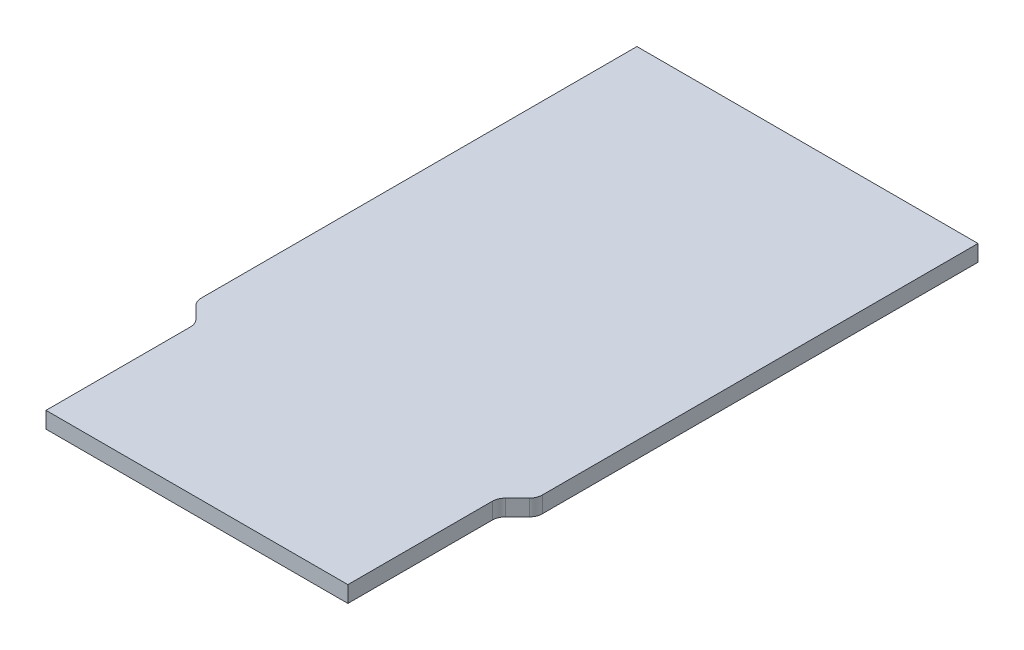
ISO-10303-21;
HEADER;
FILE_DESCRIPTION(('STEP AP214'),'2;1');
FILE_NAME('part.step','',(''),(''),'','','');
FILE_SCHEMA(('AUTOMOTIVE_DESIGN { 1 0 10303 214 1 1 1 1 }'));
ENDSEC;
DATA;
#1=APPLICATION_CONTEXT('core data for automotive mechanical design processes');
#2=APPLICATION_PROTOCOL_DEFINITION('international standard','automotive_design',2000,#1);
#3=PRODUCT_CONTEXT('',#1,'mechanical');
#4=PRODUCT('Part','Part','',(#3));
#5=PRODUCT_RELATED_PRODUCT_CATEGORY('part','',(#4));
#6=PRODUCT_DEFINITION_FORMATION('','',#4);
#7=PRODUCT_DEFINITION_CONTEXT('part definition',#1,'design');
#8=PRODUCT_DEFINITION('design','',#6,#7);
#9=PRODUCT_DEFINITION_SHAPE('','',#8);
#10=(LENGTH_UNIT() NAMED_UNIT(*) SI_UNIT(.MILLI.,.METRE.));
#11=(NAMED_UNIT(*) PLANE_ANGLE_UNIT() SI_UNIT($,.RADIAN.));
#12=(NAMED_UNIT(*) SI_UNIT($,.STERADIAN.) SOLID_ANGLE_UNIT());
#13=UNCERTAINTY_MEASURE_WITH_UNIT(LENGTH_MEASURE(1.E-05),#10,'distance_accuracy_value','');
#14=(GEOMETRIC_REPRESENTATION_CONTEXT(3) GLOBAL_UNCERTAINTY_ASSIGNED_CONTEXT((#13)) GLOBAL_UNIT_ASSIGNED_CONTEXT((#10,
#11,#12)) REPRESENTATION_CONTEXT('',''));
#15=CARTESIAN_POINT('',(0.,0.,0.));
#16=DIRECTION('',(0.,0.,1.));
#17=DIRECTION('',(1.,0.,0.));
#18=AXIS2_PLACEMENT_3D('',#15,#16,#17);
#19=CARTESIAN_POINT('',(-13.3427521616477,7.36119552615719,48.2385191324047));
#20=DIRECTION('',(0.,0.,1.));
#21=DIRECTION('',(1.,0.,0.));
#22=AXIS2_PLACEMENT_3D('',#19,#20,#21);
#23=PLANE('',#22);
#24=DIRECTION('',(1.,0.,0.));
#25=VECTOR('',#24,1.);
#26=CARTESIAN_POINT('',(-13.3427521616477,7.36119552615719,48.2385191324047));
#27=LINE('',#26,#25);
#28=CARTESIAN_POINT('',(-34.9427521616477,7.36119552615719,48.2385191324047));
#29=VERTEX_POINT('',#28);
#30=CARTESIAN_POINT('',(11.2572478383523,7.36119552615719,48.2385191324047));
#31=VERTEX_POINT('',#30);
#32=EDGE_CURVE('E207',#29,#31,#27,.T.);
#33=ORIENTED_EDGE('',*,*,#32,.T.);
#34=DIRECTION('',(0.,-1.,0.));
#35=VECTOR('',#34,1.);
#36=CARTESIAN_POINT('',(11.2572478383523,106.874534692367,48.2385191324047));
#37=LINE('',#36,#35);
#38=CARTESIAN_POINT('',(11.2572478383523,9.86119552615719,48.2385191324047));
#39=VERTEX_POINT('',#38);
#40=EDGE_CURVE('E142',#39,#31,#37,.T.);
#41=ORIENTED_EDGE('',*,*,#40,.F.);
#42=DIRECTION('',(1.,0.,0.));
#43=VECTOR('',#42,1.);
#44=CARTESIAN_POINT('',(-37.9427521616477,9.86119552615719,48.2385191324047));
#45=LINE('',#44,#43);
#46=CARTESIAN_POINT('',(-34.9427521616477,9.86119552615719,48.2385191324047));
#47=VERTEX_POINT('',#46);
#48=EDGE_CURVE('E51',#39,#47,#45,.F.);
#49=ORIENTED_EDGE('',*,*,#48,.T.);
#50=DIRECTION('',(0.,1.,0.));
#51=VECTOR('',#50,1.);
#52=CARTESIAN_POINT('',(-34.9427521616477,7.36119552615719,48.2385191324047));
#53=LINE('',#52,#51);
#54=EDGE_CURVE('E77',#29,#47,#53,.T.);
#55=ORIENTED_EDGE('',*,*,#54,.F.);
#56=EDGE_LOOP('',(#33,#41,#49,#55));
#57=FACE_BOUND('',#56,.T.);
#58=ADVANCED_FACE('F34',(#57),#23,.T.);
#59=CARTESIAN_POINT('',(-13.3427521616477,7.36119552615719,15.802027459301));
#60=DIRECTION('',(0.,1.,0.));
#61=DIRECTION('',(0.,0.,1.));
#62=AXIS2_PLACEMENT_3D('',#59,#60,#61);
#63=PLANE('',#62);
#64=DIRECTION('',(0.,0.,1.));
#65=VECTOR('',#64,1.);
#66=CARTESIAN_POINT('',(-37.9427521616477,7.36119552615719,15.802027459301));
#67=LINE('',#66,#65);
#68=CARTESIAN_POINT('',(-37.9427521616477,7.36119552615719,-45.197972540699));
#69=VERTEX_POINT('',#68);
#70=CARTESIAN_POINT('',(-37.9427521616477,7.36119552615719,21.473600334555));
#71=VERTEX_POINT('',#70);
#72=EDGE_CURVE('E193',#69,#71,#67,.T.);
#73=ORIENTED_EDGE('',*,*,#72,.F.);
#74=DIRECTION('',(-1.,0.,0.));
#75=VECTOR('',#74,1.);
#76=CARTESIAN_POINT('',(-13.3427521616477,7.36119552615719,-45.197972540699));
#77=LINE('',#76,#75);
#78=CARTESIAN_POINT('',(14.2572478383523,7.36119552615719,-45.197972540699));
#79=VERTEX_POINT('',#78);
#80=EDGE_CURVE('E168',#79,#69,#77,.T.);
#81=ORIENTED_EDGE('',*,*,#80,.F.);
#82=DIRECTION('',(0.,0.,1.));
#83=VECTOR('',#82,1.);
#84=CARTESIAN_POINT('',(14.2572478383523,7.36119552615719,-43.1979725406991));
#85=LINE('',#84,#83);
#86=CARTESIAN_POINT('',(14.2572478383523,7.36119552615719,21.473600334555));
#87=VERTEX_POINT('',#86);
#88=EDGE_CURVE('E157',#79,#87,#85,.T.);
#89=ORIENTED_EDGE('',*,*,#88,.T.);
#90=CARTESIAN_POINT('',(12.2572478383523,7.36119552615719,21.473600334555));
#91=DIRECTION('',(0.,-1.,0.));
#92=DIRECTION('',(1.,0.,0.));
#93=AXIS2_PLACEMENT_3D('',#90,#91,#92);
#94=CIRCLE('',#93,1.99999999999944);
#95=CARTESIAN_POINT('',(13.6714614007235,7.36119552615719,22.8878138969291));
#96=VERTEX_POINT('',#95);
#97=EDGE_CURVE('E170',#87,#96,#94,.T.);
#98=ORIENTED_EDGE('',*,*,#97,.T.);
#99=DIRECTION('',(-0.707106781185696,0.,0.707106781187399));
#100=VECTOR('',#99,1.);
#101=CARTESIAN_POINT('',(13.6714614007231,7.36119552615719,22.8878138969288));
#102=LINE('',#101,#100);
#103=CARTESIAN_POINT('',(11.8430342759823,7.36119552615719,24.716241021674));
#104=VERTEX_POINT('',#103);
#105=EDGE_CURVE('E173',#96,#104,#102,.T.);
#106=ORIENTED_EDGE('',*,*,#105,.T.);
#107=CARTESIAN_POINT('',(13.2572478383523,7.36119552615719,26.130454584051));
#108=DIRECTION('',(0.,1.,0.));
#109=DIRECTION('',(1.,0.,0.));
#110=AXIS2_PLACEMENT_3D('',#107,#108,#109);
#111=CIRCLE('',#110,2.00000000000043);
#112=CARTESIAN_POINT('',(11.2572478383519,7.36119552615719,26.130454584051));
#113=VERTEX_POINT('',#112);
#114=EDGE_CURVE('E176',#104,#113,#111,.T.);
#115=ORIENTED_EDGE('',*,*,#114,.T.);
#116=DIRECTION('',(0.,0.,1.));
#117=VECTOR('',#116,1.);
#118=CARTESIAN_POINT('',(11.257247838352,7.36119552615719,26.130454584051));
#119=LINE('',#118,#117);
#120=EDGE_CURVE('E179',#113,#31,#119,.T.);
#121=ORIENTED_EDGE('',*,*,#120,.T.);
#122=ORIENTED_EDGE('',*,*,#32,.F.);
#123=DIRECTION('',(0.,0.,1.));
#124=VECTOR('',#123,1.);
#125=CARTESIAN_POINT('',(-34.9427521616473,7.36119552615719,15.8020274593007));
#126=LINE('',#125,#124);
#127=CARTESIAN_POINT('',(-34.9427521616474,7.36119552615719,26.130454584051));
#128=VERTEX_POINT('',#127);
#129=EDGE_CURVE('E205',#128,#29,#126,.T.);
#130=ORIENTED_EDGE('',*,*,#129,.F.);
#131=CARTESIAN_POINT('',(-36.9427521616477,7.36119552615719,26.130454584051));
#132=DIRECTION('',(0.,1.,0.));
#133=DIRECTION('',(0.,0.,1.));
#134=AXIS2_PLACEMENT_3D('',#131,#132,#133);
#135=CIRCLE('',#134,2.00000000000043);
#136=CARTESIAN_POINT('',(-35.5285385992777,7.36119552615719,24.716241021674));
#137=VERTEX_POINT('',#136);
#138=EDGE_CURVE('E202',#128,#137,#135,.T.);
#139=ORIENTED_EDGE('',*,*,#138,.T.);
#140=DIRECTION('',(0.707106781185696,0.,0.707106781187399));
#141=VECTOR('',#140,1.);
#142=CARTESIAN_POINT('',(-28.8927521616759,7.36119552615719,31.3520274592917));
#143=LINE('',#142,#141);
#144=CARTESIAN_POINT('',(-37.3569657240185,7.36119552615719,22.8878138969288));
#145=VERTEX_POINT('',#144);
#146=EDGE_CURVE('E199',#145,#137,#143,.T.);
#147=ORIENTED_EDGE('',*,*,#146,.F.);
#148=CARTESIAN_POINT('',(-35.9427521616477,7.36119552615719,21.473600334555));
#149=DIRECTION('',(0.,1.,0.));
#150=DIRECTION('',(0.,0.,1.));
#151=AXIS2_PLACEMENT_3D('',#148,#149,#150);
#152=CIRCLE('',#151,1.99999999999943);
#153=EDGE_CURVE('E196',#71,#145,#152,.T.);
#154=ORIENTED_EDGE('',*,*,#153,.F.);
#155=EDGE_LOOP('',(#73,#81,#89,#98,#106,#115,#121,#122,#130,#139,#147,#154));
#156=FACE_BOUND('',#155,.T.);
#157=ADVANCED_FACE('F228',(#156),#63,.F.);
#158=CARTESIAN_POINT('',(-34.9427521616477,43.7450790026372,47.185910935781));
#159=DIRECTION('',(1.,0.,0.));
#160=DIRECTION('',(0.,0.,-1.));
#161=AXIS2_PLACEMENT_3D('',#158,#159,#160);
#162=PLANE('',#161);
#163=ORIENTED_EDGE('',*,*,#54,.T.);
#164=DIRECTION('',(0.,0.,-1.));
#165=VECTOR('',#164,1.);
#166=CARTESIAN_POINT('',(-34.9427521616477,9.86119552615719,46.302027459301));
#167=LINE('',#166,#165);
#168=CARTESIAN_POINT('',(-34.9427521616477,9.86119552615719,26.130454584051));
#169=VERTEX_POINT('',#168);
#170=EDGE_CURVE('E73',#47,#169,#167,.T.);
#171=ORIENTED_EDGE('',*,*,#170,.T.);
#172=DIRECTION('',(0.,-1.,0.));
#173=VECTOR('',#172,1.);
#174=CARTESIAN_POINT('',(-34.9427521616477,9.86119552615719,26.130454584051));
#175=LINE('',#174,#173);
#176=EDGE_CURVE('E38',#169,#128,#175,.T.);
#177=ORIENTED_EDGE('',*,*,#176,.T.);
#178=ORIENTED_EDGE('',*,*,#129,.T.);
#179=EDGE_LOOP('',(#163,#171,#177,#178));
#180=FACE_BOUND('',#179,.T.);
#181=ADVANCED_FACE('F235',(#180),#162,.F.);
#182=CARTESIAN_POINT('',(-37.9427521616477,9.86119552615719,-45.197972540699));
#183=DIRECTION('',(0.,1.,0.));
#184=DIRECTION('',(0.,0.,-1.));
#185=AXIS2_PLACEMENT_3D('',#182,#183,#184);
#186=PLANE('',#185);
#187=DIRECTION('',(0.,0.,-1.));
#188=VECTOR('',#187,1.);
#189=CARTESIAN_POINT('',(14.2572478383523,9.86119552615719,-43.1979725406991));
#190=LINE('',#189,#188);
#191=CARTESIAN_POINT('',(14.2572478383523,9.86119552615719,21.473600334555));
#192=VERTEX_POINT('',#191);
#193=CARTESIAN_POINT('',(14.2572478383523,9.86119552615719,-45.197972540699));
#194=VERTEX_POINT('',#193);
#195=EDGE_CURVE('E132',#192,#194,#190,.T.);
#196=ORIENTED_EDGE('',*,*,#195,.T.);
#197=DIRECTION('',(1.,0.,0.));
#198=VECTOR('',#197,1.);
#199=CARTESIAN_POINT('',(-35.9427521616477,9.86119552615719,-45.197972540699));
#200=LINE('',#199,#198);
#201=CARTESIAN_POINT('',(-37.9427521616477,9.86119552615719,-45.197972540699));
#202=VERTEX_POINT('',#201);
#203=EDGE_CURVE('E135',#202,#194,#200,.T.);
#204=ORIENTED_EDGE('',*,*,#203,.F.);
#205=DIRECTION('',(0.,0.,1.));
#206=VECTOR('',#205,1.);
#207=CARTESIAN_POINT('',(-37.9427521616477,9.86119552615719,-43.197972540699));
#208=LINE('',#207,#206);
#209=CARTESIAN_POINT('',(-37.9427521616477,9.86119552615719,21.473600334555));
#210=VERTEX_POINT('',#209);
#211=EDGE_CURVE('E11',#202,#210,#208,.T.);
#212=ORIENTED_EDGE('',*,*,#211,.T.);
#213=CARTESIAN_POINT('',(-35.9427521616477,9.86119552615719,21.473600334555));
#214=DIRECTION('',(0.,1.,0.));
#215=DIRECTION('',(-1.,0.,0.));
#216=AXIS2_PLACEMENT_3D('',#213,#214,#215);
#217=CIRCLE('',#216,2.);
#218=CARTESIAN_POINT('',(-37.3569657240177,9.86119552615719,22.887813896928));
#219=VERTEX_POINT('',#218);
#220=EDGE_CURVE('E43',#210,#219,#217,.T.);
#221=ORIENTED_EDGE('',*,*,#220,.T.);
#222=DIRECTION('',(-0.707106781186548,0.,-0.707106781186548));
#223=VECTOR('',#222,1.);
#224=CARTESIAN_POINT('',(-35.5285385992777,9.86119552615719,24.716241021674));
#225=LINE('',#224,#223);
#226=CARTESIAN_POINT('',(-35.5285385992777,9.86119552615719,24.716241021674));
#227=VERTEX_POINT('',#226);
#228=EDGE_CURVE('E212',#227,#219,#225,.T.);
#229=ORIENTED_EDGE('',*,*,#228,.F.);
#230=CARTESIAN_POINT('',(-36.9427521616477,9.86119552615719,26.130454584051));
#231=DIRECTION('',(0.,-1.,0.));
#232=DIRECTION('',(0.707106781186548,0.,-0.707106781186548));
#233=AXIS2_PLACEMENT_3D('',#230,#231,#232);
#234=CIRCLE('',#233,2.);
#235=EDGE_CURVE('E151',#227,#169,#234,.T.);
#236=ORIENTED_EDGE('',*,*,#235,.T.);
#237=ORIENTED_EDGE('',*,*,#170,.F.);
#238=ORIENTED_EDGE('',*,*,#48,.F.);
#239=DIRECTION('',(0.,0.,-1.));
#240=VECTOR('',#239,1.);
#241=CARTESIAN_POINT('',(11.257247838352,9.86119552615719,26.130454584051));
#242=LINE('',#241,#240);
#243=CARTESIAN_POINT('',(11.2572478383519,9.86119552615719,26.130454584051));
#244=VERTEX_POINT('',#243);
#245=EDGE_CURVE('E166',#39,#244,#242,.T.);
#246=ORIENTED_EDGE('',*,*,#245,.T.);
#247=CARTESIAN_POINT('',(13.2572478383523,9.86119552615719,26.130454584051));
#248=DIRECTION('',(0.,-1.,0.));
#249=DIRECTION('',(1.,0.,0.));
#250=AXIS2_PLACEMENT_3D('',#247,#248,#249);
#251=CIRCLE('',#250,2.00000000000043);
#252=CARTESIAN_POINT('',(11.8430342759823,9.86119552615719,24.716241021674));
#253=VERTEX_POINT('',#252);
#254=EDGE_CURVE('E164',#244,#253,#251,.T.);
#255=ORIENTED_EDGE('',*,*,#254,.T.);
#256=DIRECTION('',(0.707106781185696,0.,-0.707106781187399));
#257=VECTOR('',#256,1.);
#258=CARTESIAN_POINT('',(13.6714614007231,9.86119552615719,22.8878138969288));
#259=LINE('',#258,#257);
#260=CARTESIAN_POINT('',(13.6714614007235,9.86119552615719,22.8878138969291));
#261=VERTEX_POINT('',#260);
#262=EDGE_CURVE('E162',#253,#261,#259,.T.);
#263=ORIENTED_EDGE('',*,*,#262,.T.);
#264=CARTESIAN_POINT('',(12.2572478383523,9.86119552615719,21.473600334555));
#265=DIRECTION('',(0.,-1.,0.));
#266=DIRECTION('',(1.,0.,0.));
#267=AXIS2_PLACEMENT_3D('',#264,#265,#266);
#268=CIRCLE('',#267,1.99999999999944);
#269=EDGE_CURVE('E138',#261,#192,#268,.F.);
#270=ORIENTED_EDGE('',*,*,#269,.T.);
#271=EDGE_LOOP('',(#196,#204,#212,#221,#229,#236,#237,#238,#246,#255,#263,#270));
#272=FACE_BOUND('',#271,.T.);
#273=ADVANCED_FACE('F134',(#272),#186,.T.);
#274=CARTESIAN_POINT('',(-13.3427521616477,9.11119552615719,-45.197972540699));
#275=DIRECTION('',(0.,0.,1.));
#276=DIRECTION('',(-1.,0.,0.));
#277=AXIS2_PLACEMENT_3D('',#274,#275,#276);
#278=PLANE('',#277);
#279=ORIENTED_EDGE('',*,*,#203,.T.);
#280=DIRECTION('',(0.,1.,0.));
#281=VECTOR('',#280,1.);
#282=CARTESIAN_POINT('',(14.2572478383523,-44.8771045993254,-45.197972540699));
#283=LINE('',#282,#281);
#284=EDGE_CURVE('E148',#79,#194,#283,.T.);
#285=ORIENTED_EDGE('',*,*,#284,.F.);
#286=ORIENTED_EDGE('',*,*,#80,.T.);
#287=DIRECTION('',(0.,1.,0.));
#288=VECTOR('',#287,1.);
#289=CARTESIAN_POINT('',(-37.9427521616477,-44.8771045993254,-45.197972540699));
#290=LINE('',#289,#288);
#291=EDGE_CURVE('E150',#69,#202,#290,.T.);
#292=ORIENTED_EDGE('',*,*,#291,.T.);
#293=EDGE_LOOP('',(#279,#285,#286,#292));
#294=FACE_BOUND('',#293,.T.);
#295=ADVANCED_FACE('F147',(#294),#278,.F.);
#296=CARTESIAN_POINT('',(-37.9427521616477,9.11119552615719,0.552027459300955));
#297=DIRECTION('',(-1.,0.,0.));
#298=DIRECTION('',(0.,0.,-1.));
#299=AXIS2_PLACEMENT_3D('',#296,#297,#298);
#300=PLANE('',#299);
#301=ORIENTED_EDGE('',*,*,#211,.F.);
#302=ORIENTED_EDGE('',*,*,#291,.F.);
#303=ORIENTED_EDGE('',*,*,#72,.T.);
#304=DIRECTION('',(0.,1.,0.));
#305=VECTOR('',#304,1.);
#306=CARTESIAN_POINT('',(-37.9427521616477,8.36119552615719,21.473600334555));
#307=LINE('',#306,#305);
#308=EDGE_CURVE('E152',#71,#210,#307,.T.);
#309=ORIENTED_EDGE('',*,*,#308,.T.);
#310=EDGE_LOOP('',(#301,#302,#303,#309));
#311=FACE_BOUND('',#310,.T.);
#312=ADVANCED_FACE('F233',(#311),#300,.T.);
#313=CARTESIAN_POINT('',(-35.9427521616477,-39.2202044738428,21.473600334555));
#314=DIRECTION('',(0.,1.,0.));
#315=DIRECTION('',(1.,0.,0.));
#316=AXIS2_PLACEMENT_3D('',#313,#314,#315);
#317=CYLINDRICAL_SURFACE('',#316,2.);
#318=ORIENTED_EDGE('',*,*,#308,.F.);
#319=ORIENTED_EDGE('',*,*,#153,.T.);
#320=DIRECTION('',(0.,1.,0.));
#321=VECTOR('',#320,1.);
#322=CARTESIAN_POINT('',(-37.3569657240177,8.36119552615719,22.887813896928));
#323=LINE('',#322,#321);
#324=EDGE_CURVE('E214',#145,#219,#323,.T.);
#325=ORIENTED_EDGE('',*,*,#324,.T.);
#326=ORIENTED_EDGE('',*,*,#220,.F.);
#327=EDGE_LOOP('',(#318,#319,#325,#326));
#328=FACE_BOUND('',#327,.T.);
#329=ADVANCED_FACE('F231',(#328),#317,.T.);
#330=CARTESIAN_POINT('',(-36.4427521616477,9.11119552615719,23.802027459301));
#331=DIRECTION('',(0.707106781186548,0.,-0.707106781186548));
#332=DIRECTION('',(0.707106781186548,0.,0.707106781186548));
#333=AXIS2_PLACEMENT_3D('',#330,#331,#332);
#334=PLANE('',#333);
#335=ORIENTED_EDGE('',*,*,#324,.F.);
#336=ORIENTED_EDGE('',*,*,#146,.T.);
#337=DIRECTION('',(0.,-1.,0.));
#338=VECTOR('',#337,1.);
#339=CARTESIAN_POINT('',(-35.5285385992777,9.86119552615719,24.716241021674));
#340=LINE('',#339,#338);
#341=EDGE_CURVE('E215',#227,#137,#340,.T.);
#342=ORIENTED_EDGE('',*,*,#341,.F.);
#343=ORIENTED_EDGE('',*,*,#228,.T.);
#344=EDGE_LOOP('',(#335,#336,#342,#343));
#345=FACE_BOUND('',#344,.T.);
#346=ADVANCED_FACE('F230',(#345),#334,.F.);
#347=CARTESIAN_POINT('',(-36.9427521616477,92.4425955261572,26.130454584051));
#348=DIRECTION('',(0.,-1.,0.));
#349=DIRECTION('',(-0.707106781186547,0.,0.707106781186548));
#350=AXIS2_PLACEMENT_3D('',#347,#348,#349);
#351=CYLINDRICAL_SURFACE('',#350,2.);
#352=ORIENTED_EDGE('',*,*,#341,.T.);
#353=ORIENTED_EDGE('',*,*,#138,.F.);
#354=ORIENTED_EDGE('',*,*,#176,.F.);
#355=ORIENTED_EDGE('',*,*,#235,.F.);
#356=EDGE_LOOP('',(#352,#353,#354,#355));
#357=FACE_BOUND('',#356,.T.);
#358=ADVANCED_FACE('F36',(#357),#351,.F.);
#359=CARTESIAN_POINT('',(11.257247838352,106.874534692367,26.130454584051));
#360=DIRECTION('',(1.,0.,0.));
#361=DIRECTION('',(0.,0.,-1.));
#362=AXIS2_PLACEMENT_3D('',#359,#360,#361);
#363=PLANE('',#362);
#364=ORIENTED_EDGE('',*,*,#245,.F.);
#365=ORIENTED_EDGE('',*,*,#40,.T.);
#366=ORIENTED_EDGE('',*,*,#120,.F.);
#367=DIRECTION('',(0.,-1.,0.));
#368=VECTOR('',#367,1.);
#369=CARTESIAN_POINT('',(11.2572478383519,106.874534692367,26.130454584051));
#370=LINE('',#369,#368);
#371=EDGE_CURVE('E185',#244,#113,#370,.T.);
#372=ORIENTED_EDGE('',*,*,#371,.F.);
#373=EDGE_LOOP('',(#364,#365,#366,#372));
#374=FACE_BOUND('',#373,.T.);
#375=ADVANCED_FACE('F262',(#374),#363,.T.);
#376=CARTESIAN_POINT('',(13.2572478383523,106.874534692367,26.130454584051));
#377=DIRECTION('',(0.,-1.,0.));
#378=DIRECTION('',(1.,0.,0.));
#379=AXIS2_PLACEMENT_3D('',#376,#377,#378);
#380=CYLINDRICAL_SURFACE('',#379,2.00000000000043);
#381=ORIENTED_EDGE('',*,*,#254,.F.);
#382=ORIENTED_EDGE('',*,*,#371,.T.);
#383=ORIENTED_EDGE('',*,*,#114,.F.);
#384=DIRECTION('',(0.,-1.,0.));
#385=VECTOR('',#384,1.);
#386=CARTESIAN_POINT('',(11.8430342759823,106.874534692367,24.716241021674));
#387=LINE('',#386,#385);
#388=EDGE_CURVE('E187',#253,#104,#387,.T.);
#389=ORIENTED_EDGE('',*,*,#388,.F.);
#390=EDGE_LOOP('',(#381,#382,#383,#389));
#391=FACE_BOUND('',#390,.T.);
#392=ADVANCED_FACE('F258',(#391),#380,.F.);
#393=CARTESIAN_POINT('',(13.6714614007231,106.874534692367,22.8878138969288));
#394=DIRECTION('',(0.707106781187399,0.,0.707106781185696));
#395=DIRECTION('',(0.707106781185696,0.,-0.707106781187399));
#396=AXIS2_PLACEMENT_3D('',#393,#394,#395);
#397=PLANE('',#396);
#398=ORIENTED_EDGE('',*,*,#262,.F.);
#399=ORIENTED_EDGE('',*,*,#388,.T.);
#400=ORIENTED_EDGE('',*,*,#105,.F.);
#401=DIRECTION('',(0.,-1.,0.));
#402=VECTOR('',#401,1.);
#403=CARTESIAN_POINT('',(13.6714614007235,106.874534692367,22.8878138969292));
#404=LINE('',#403,#402);
#405=EDGE_CURVE('E189',#261,#96,#404,.T.);
#406=ORIENTED_EDGE('',*,*,#405,.F.);
#407=EDGE_LOOP('',(#398,#399,#400,#406));
#408=FACE_BOUND('',#407,.T.);
#409=ADVANCED_FACE('F254',(#408),#397,.T.);
#410=CARTESIAN_POINT('',(12.2572478383523,106.874534692367,21.473600334555));
#411=DIRECTION('',(0.,-1.,0.));
#412=DIRECTION('',(1.,0.,0.));
#413=AXIS2_PLACEMENT_3D('',#410,#411,#412);
#414=CYLINDRICAL_SURFACE('',#413,1.99999999999944);
#415=ORIENTED_EDGE('',*,*,#269,.F.);
#416=ORIENTED_EDGE('',*,*,#405,.T.);
#417=ORIENTED_EDGE('',*,*,#97,.F.);
#418=DIRECTION('',(0.,-1.,0.));
#419=VECTOR('',#418,1.);
#420=CARTESIAN_POINT('',(14.2572478383523,106.874534692367,21.473600334555));
#421=LINE('',#420,#419);
#422=EDGE_CURVE('E182',#192,#87,#421,.T.);
#423=ORIENTED_EDGE('',*,*,#422,.F.);
#424=EDGE_LOOP('',(#415,#416,#417,#423));
#425=FACE_BOUND('',#424,.T.);
#426=ADVANCED_FACE('F251',(#425),#414,.T.);
#427=CARTESIAN_POINT('',(14.2572478383523,106.874534692367,-43.197972540699));
#428=DIRECTION('',(1.,0.,0.));
#429=DIRECTION('',(0.,1.,0.));
#430=AXIS2_PLACEMENT_3D('',#427,#428,#429);
#431=PLANE('',#430);
#432=ORIENTED_EDGE('',*,*,#195,.F.);
#433=ORIENTED_EDGE('',*,*,#422,.T.);
#434=ORIENTED_EDGE('',*,*,#88,.F.);
#435=ORIENTED_EDGE('',*,*,#284,.T.);
#436=EDGE_LOOP('',(#432,#433,#434,#435));
#437=FACE_BOUND('',#436,.T.);
#438=ADVANCED_FACE('F155',(#437),#431,.T.);
#439=CLOSED_SHELL('',(#58,#157,#181,#273,#295,#312,#329,#346,#358,#375,#392,#409,#426,#438));
#440=MANIFOLD_SOLID_BREP('B2',#439);
#441=ADVANCED_BREP_SHAPE_REPRESENTATION('',(#18,#440),#14);
#442=SHAPE_DEFINITION_REPRESENTATION(#9,#441);
ENDSEC;
END-ISO-10303-21;
